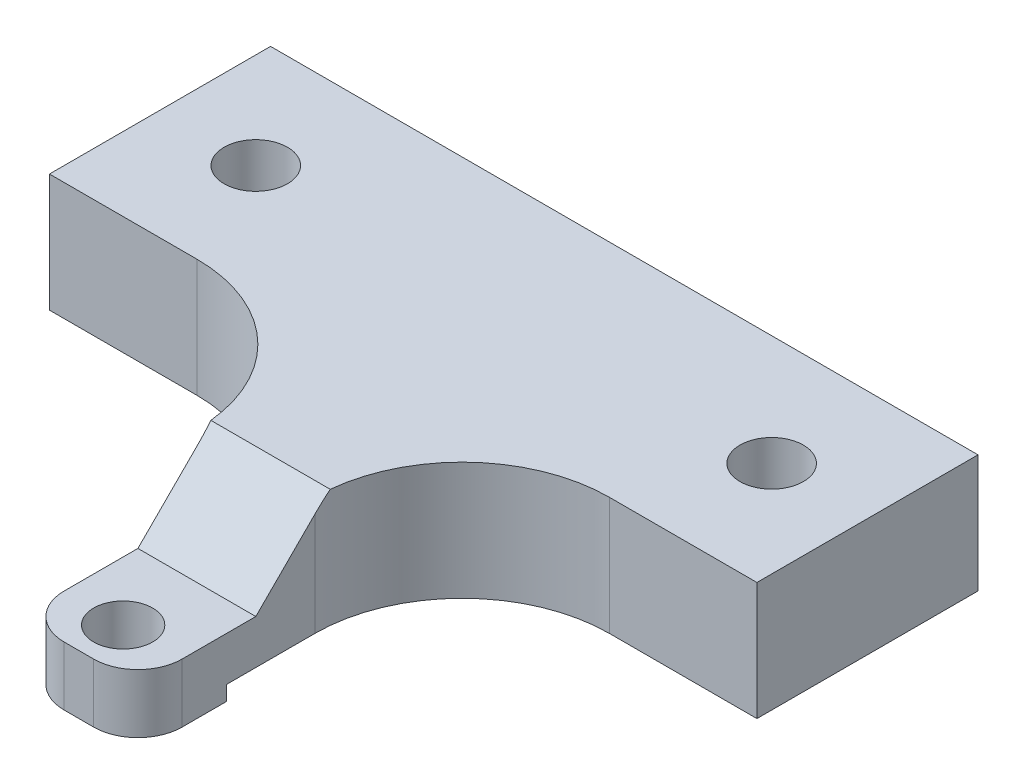
ISO-10303-21;
HEADER;
FILE_DESCRIPTION(('STEP AP214'),'2;1');
FILE_NAME('part.step','',(''),(''),'','','');
FILE_SCHEMA(('AUTOMOTIVE_DESIGN { 1 0 10303 214 1 1 1 1 }'));
ENDSEC;
DATA;
#1=APPLICATION_CONTEXT('core data for automotive mechanical design processes');
#2=APPLICATION_PROTOCOL_DEFINITION('international standard','automotive_design',2000,#1);
#3=PRODUCT_CONTEXT('',#1,'mechanical');
#4=PRODUCT('Part','Part','',(#3));
#5=PRODUCT_RELATED_PRODUCT_CATEGORY('part','',(#4));
#6=PRODUCT_DEFINITION_FORMATION('','',#4);
#7=PRODUCT_DEFINITION_CONTEXT('part definition',#1,'design');
#8=PRODUCT_DEFINITION('design','',#6,#7);
#9=PRODUCT_DEFINITION_SHAPE('','',#8);
#10=(LENGTH_UNIT() NAMED_UNIT(*) SI_UNIT(.MILLI.,.METRE.));
#11=(NAMED_UNIT(*) PLANE_ANGLE_UNIT() SI_UNIT($,.RADIAN.));
#12=(NAMED_UNIT(*) SI_UNIT($,.STERADIAN.) SOLID_ANGLE_UNIT());
#13=UNCERTAINTY_MEASURE_WITH_UNIT(LENGTH_MEASURE(1.E-05),#10,'distance_accuracy_value','');
#14=(GEOMETRIC_REPRESENTATION_CONTEXT(3) GLOBAL_UNCERTAINTY_ASSIGNED_CONTEXT((#13)) GLOBAL_UNIT_ASSIGNED_CONTEXT((#10,
#11,#12)) REPRESENTATION_CONTEXT('',''));
#15=CARTESIAN_POINT('',(0.,0.,0.));
#16=DIRECTION('',(0.,0.,1.));
#17=DIRECTION('',(1.,0.,0.));
#18=AXIS2_PLACEMENT_3D('',#15,#16,#17);
#19=CARTESIAN_POINT('',(0.,0.,0.));
#20=DIRECTION('',(0.,1.,0.));
#21=DIRECTION('',(0.,0.,1.));
#22=AXIS2_PLACEMENT_3D('',#19,#20,#21);
#23=PLANE('',#22);
#24=CARTESIAN_POINT('',(17.5,0.,-11.));
#25=DIRECTION('',(0.,-1.,0.));
#26=DIRECTION('',(0.,0.,-1.));
#27=AXIS2_PLACEMENT_3D('',#24,#25,#26);
#28=CIRCLE('',#27,3.99999999999999);
#29=CARTESIAN_POINT('',(17.5,0.,-15.));
#30=VERTEX_POINT('',#29);
#31=EDGE_CURVE('E179',#30,#30,#28,.T.);
#32=ORIENTED_EDGE('',*,*,#31,.F.);
#33=EDGE_LOOP('',(#32));
#34=FACE_BOUND('',#33,.T.);
#35=CARTESIAN_POINT('',(-17.5,0.,-11.));
#36=DIRECTION('',(0.,-1.,0.));
#37=DIRECTION('',(0.,0.,-1.));
#38=AXIS2_PLACEMENT_3D('',#35,#36,#37);
#39=CIRCLE('',#38,3.99999999999999);
#40=CARTESIAN_POINT('',(-17.5,0.,-15.));
#41=VERTEX_POINT('',#40);
#42=EDGE_CURVE('E194',#41,#41,#39,.T.);
#43=ORIENTED_EDGE('',*,*,#42,.F.);
#44=EDGE_LOOP('',(#43));
#45=FACE_BOUND('',#44,.T.);
#46=DIRECTION('',(1.,0.,0.));
#47=VECTOR('',#46,1.);
#48=CARTESIAN_POINT('',(4.,0.,12.5));
#49=LINE('',#48,#47);
#50=CARTESIAN_POINT('',(-4.,0.,12.5));
#51=VERTEX_POINT('',#50);
#52=CARTESIAN_POINT('',(4.,0.,12.5));
#53=VERTEX_POINT('',#52);
#54=EDGE_CURVE('E210',#51,#53,#49,.T.);
#55=ORIENTED_EDGE('',*,*,#54,.F.);
#56=DIRECTION('',(0.,0.,-1.));
#57=VECTOR('',#56,1.);
#58=CARTESIAN_POINT('',(-4.,0.,18.5));
#59=LINE('',#58,#57);
#60=CARTESIAN_POINT('',(-4.,0.,6.5));
#61=VERTEX_POINT('',#60);
#62=EDGE_CURVE('E225',#51,#61,#59,.T.);
#63=ORIENTED_EDGE('',*,*,#62,.T.);
#64=CARTESIAN_POINT('',(-14.,0.,6.5));
#65=DIRECTION('',(0.,1.,0.));
#66=DIRECTION('',(0.,0.,1.));
#67=AXIS2_PLACEMENT_3D('',#64,#65,#66);
#68=CIRCLE('',#67,10.);
#69=CARTESIAN_POINT('',(-14.,0.,-3.5));
#70=VERTEX_POINT('',#69);
#71=EDGE_CURVE('E242',#61,#70,#68,.T.);
#72=ORIENTED_EDGE('',*,*,#71,.T.);
#73=DIRECTION('',(-1.,0.,0.));
#74=VECTOR('',#73,1.);
#75=CARTESIAN_POINT('',(-24.,0.,-3.5));
#76=LINE('',#75,#74);
#77=CARTESIAN_POINT('',(-24.,0.,-3.5));
#78=VERTEX_POINT('',#77);
#79=EDGE_CURVE('E347',#70,#78,#76,.T.);
#80=ORIENTED_EDGE('',*,*,#79,.T.);
#81=DIRECTION('',(0.,0.,1.));
#82=VECTOR('',#81,1.);
#83=CARTESIAN_POINT('',(-24.,0.,18.5));
#84=LINE('',#83,#82);
#85=CARTESIAN_POINT('',(-24.,0.,-18.5));
#86=VERTEX_POINT('',#85);
#87=EDGE_CURVE('E353',#86,#78,#84,.T.);
#88=ORIENTED_EDGE('',*,*,#87,.F.);
#89=DIRECTION('',(-1.,0.,0.));
#90=VECTOR('',#89,1.);
#91=CARTESIAN_POINT('',(24.,0.,-18.5));
#92=LINE('',#91,#90);
#93=CARTESIAN_POINT('',(24.,0.,-18.5));
#94=VERTEX_POINT('',#93);
#95=EDGE_CURVE('E358',#94,#86,#92,.T.);
#96=ORIENTED_EDGE('',*,*,#95,.F.);
#97=DIRECTION('',(0.,0.,-1.));
#98=VECTOR('',#97,1.);
#99=CARTESIAN_POINT('',(24.,0.,18.5));
#100=LINE('',#99,#98);
#101=CARTESIAN_POINT('',(24.,0.,-3.50000000000001));
#102=VERTEX_POINT('',#101);
#103=EDGE_CURVE('E365',#102,#94,#100,.T.);
#104=ORIENTED_EDGE('',*,*,#103,.F.);
#105=DIRECTION('',(-1.,0.,0.));
#106=VECTOR('',#105,1.);
#107=CARTESIAN_POINT('',(24.,0.,-3.50000000000001));
#108=LINE('',#107,#106);
#109=CARTESIAN_POINT('',(14.,0.,-3.50000000000001));
#110=VERTEX_POINT('',#109);
#111=EDGE_CURVE('E219',#102,#110,#108,.T.);
#112=ORIENTED_EDGE('',*,*,#111,.T.);
#113=CARTESIAN_POINT('',(14.,0.,6.5));
#114=DIRECTION('',(0.,1.,0.));
#115=DIRECTION('',(0.,0.,1.));
#116=AXIS2_PLACEMENT_3D('',#113,#114,#115);
#117=CIRCLE('',#116,10.);
#118=CARTESIAN_POINT('',(4.,0.,6.5));
#119=VERTEX_POINT('',#118);
#120=EDGE_CURVE('E333',#110,#119,#117,.T.);
#121=ORIENTED_EDGE('',*,*,#120,.T.);
#122=DIRECTION('',(0.,0.,1.));
#123=VECTOR('',#122,1.);
#124=CARTESIAN_POINT('',(4.,0.,18.5));
#125=LINE('',#124,#123);
#126=EDGE_CURVE('E339',#119,#53,#125,.T.);
#127=ORIENTED_EDGE('',*,*,#126,.T.);
#128=EDGE_LOOP('',(#55,#63,#72,#80,#88,#96,#104,#112,#121,#127));
#129=FACE_BOUND('',#128,.T.);
#130=ADVANCED_FACE('F34',(#34,#45,#129),#23,.F.);
#131=CARTESIAN_POINT('',(-24.,8.,18.5));
#132=DIRECTION('',(1.,0.,0.));
#133=DIRECTION('',(0.,0.,-1.));
#134=AXIS2_PLACEMENT_3D('',#131,#132,#133);
#135=PLANE('',#134);
#136=ORIENTED_EDGE('',*,*,#87,.T.);
#137=DIRECTION('',(0.,1.,0.));
#138=VECTOR('',#137,1.);
#139=CARTESIAN_POINT('',(-24.,0.,-3.5));
#140=LINE('',#139,#138);
#141=CARTESIAN_POINT('',(-24.,8.,-3.5));
#142=VERTEX_POINT('',#141);
#143=EDGE_CURVE('E349',#78,#142,#140,.T.);
#144=ORIENTED_EDGE('',*,*,#143,.T.);
#145=DIRECTION('',(0.,0.,1.));
#146=VECTOR('',#145,1.);
#147=CARTESIAN_POINT('',(-24.,8.,18.5));
#148=LINE('',#147,#146);
#149=CARTESIAN_POINT('',(-24.,8.,-18.5));
#150=VERTEX_POINT('',#149);
#151=EDGE_CURVE('E354',#150,#142,#148,.T.);
#152=ORIENTED_EDGE('',*,*,#151,.F.);
#153=DIRECTION('',(0.,-1.,0.));
#154=VECTOR('',#153,1.);
#155=CARTESIAN_POINT('',(-24.,8.,-18.5));
#156=LINE('',#155,#154);
#157=EDGE_CURVE('E362',#150,#86,#156,.T.);
#158=ORIENTED_EDGE('',*,*,#157,.T.);
#159=EDGE_LOOP('',(#136,#144,#152,#158));
#160=FACE_BOUND('',#159,.T.);
#161=ADVANCED_FACE('F273',(#160),#135,.F.);
#162=CARTESIAN_POINT('',(24.,8.,18.5));
#163=DIRECTION('',(0.,0.,-1.));
#164=DIRECTION('',(-1.,0.,0.));
#165=AXIS2_PLACEMENT_3D('',#162,#163,#164);
#166=PLANE('',#165);
#167=DIRECTION('',(-1.,0.,0.));
#168=VECTOR('',#167,1.);
#169=CARTESIAN_POINT('',(4.,-1.,18.5));
#170=LINE('',#169,#168);
#171=CARTESIAN_POINT('',(1.,-1.,18.5));
#172=VERTEX_POINT('',#171);
#173=CARTESIAN_POINT('',(-0.999999999999997,-1.,18.5));
#174=VERTEX_POINT('',#173);
#175=EDGE_CURVE('E209',#172,#174,#170,.T.);
#176=ORIENTED_EDGE('',*,*,#175,.F.);
#177=DIRECTION('',(0.,1.,0.));
#178=VECTOR('',#177,1.);
#179=CARTESIAN_POINT('',(1.,8.,18.5));
#180=LINE('',#179,#178);
#181=CARTESIAN_POINT('',(1.,3.,18.5));
#182=VERTEX_POINT('',#181);
#183=EDGE_CURVE('E248',#172,#182,#180,.T.);
#184=ORIENTED_EDGE('',*,*,#183,.T.);
#185=DIRECTION('',(1.,0.,0.));
#186=VECTOR('',#185,1.);
#187=CARTESIAN_POINT('',(-4.,3.,18.5));
#188=LINE('',#187,#186);
#189=CARTESIAN_POINT('',(-0.999999999999998,3.,18.5));
#190=VERTEX_POINT('',#189);
#191=EDGE_CURVE('E159',#190,#182,#188,.T.);
#192=ORIENTED_EDGE('',*,*,#191,.F.);
#193=DIRECTION('',(0.,1.,0.));
#194=VECTOR('',#193,1.);
#195=CARTESIAN_POINT('',(-0.999999999999997,8.,18.5));
#196=LINE('',#195,#194);
#197=EDGE_CURVE('E170',#190,#174,#196,.F.);
#198=ORIENTED_EDGE('',*,*,#197,.T.);
#199=EDGE_LOOP('',(#176,#184,#192,#198));
#200=FACE_BOUND('',#199,.T.);
#201=ADVANCED_FACE('F261',(#200),#166,.F.);
#202=CARTESIAN_POINT('',(24.,8.,18.5));
#203=DIRECTION('',(-1.,0.,0.));
#204=DIRECTION('',(0.,0.,1.));
#205=AXIS2_PLACEMENT_3D('',#202,#203,#204);
#206=PLANE('',#205);
#207=DIRECTION('',(0.,0.,-1.));
#208=VECTOR('',#207,1.);
#209=CARTESIAN_POINT('',(24.,8.,18.5));
#210=LINE('',#209,#208);
#211=CARTESIAN_POINT('',(24.,8.,-3.50000000000001));
#212=VERTEX_POINT('',#211);
#213=CARTESIAN_POINT('',(24.,8.,-18.5));
#214=VERTEX_POINT('',#213);
#215=EDGE_CURVE('E357',#212,#214,#210,.T.);
#216=ORIENTED_EDGE('',*,*,#215,.F.);
#217=DIRECTION('',(0.,1.,0.));
#218=VECTOR('',#217,1.);
#219=CARTESIAN_POINT('',(24.,0.,-3.50000000000001));
#220=LINE('',#219,#218);
#221=EDGE_CURVE('E340',#102,#212,#220,.T.);
#222=ORIENTED_EDGE('',*,*,#221,.F.);
#223=ORIENTED_EDGE('',*,*,#103,.T.);
#224=DIRECTION('',(0.,-1.,0.));
#225=VECTOR('',#224,1.);
#226=CARTESIAN_POINT('',(24.,8.,-18.5));
#227=LINE('',#226,#225);
#228=EDGE_CURVE('E370',#214,#94,#227,.T.);
#229=ORIENTED_EDGE('',*,*,#228,.F.);
#230=EDGE_LOOP('',(#216,#222,#223,#229));
#231=FACE_BOUND('',#230,.T.);
#232=ADVANCED_FACE('F290',(#231),#206,.F.);
#233=CARTESIAN_POINT('',(24.,8.,-18.5));
#234=DIRECTION('',(0.,0.,1.));
#235=DIRECTION('',(1.,0.,0.));
#236=AXIS2_PLACEMENT_3D('',#233,#234,#235);
#237=PLANE('',#236);
#238=ORIENTED_EDGE('',*,*,#95,.T.);
#239=ORIENTED_EDGE('',*,*,#157,.F.);
#240=DIRECTION('',(-1.,0.,0.));
#241=VECTOR('',#240,1.);
#242=CARTESIAN_POINT('',(24.,8.,-18.5));
#243=LINE('',#242,#241);
#244=EDGE_CURVE('E360',#214,#150,#243,.T.);
#245=ORIENTED_EDGE('',*,*,#244,.F.);
#246=ORIENTED_EDGE('',*,*,#228,.T.);
#247=EDGE_LOOP('',(#238,#239,#245,#246));
#248=FACE_BOUND('',#247,.T.);
#249=ADVANCED_FACE('F287',(#248),#237,.F.);
#250=CARTESIAN_POINT('',(0.,8.,0.));
#251=DIRECTION('',(0.,1.,0.));
#252=DIRECTION('',(0.,0.,1.));
#253=AXIS2_PLACEMENT_3D('',#250,#251,#252);
#254=PLANE('',#253);
#255=CARTESIAN_POINT('',(-14.,8.,6.5));
#256=DIRECTION('',(0.,1.,0.));
#257=DIRECTION('',(0.,0.,1.));
#258=AXIS2_PLACEMENT_3D('',#255,#256,#257);
#259=CIRCLE('',#258,10.);
#260=CARTESIAN_POINT('',(-14.,8.,-3.5));
#261=VERTEX_POINT('',#260);
#262=CARTESIAN_POINT('',(-4.0501256289338,8.,5.49999999999999));
#263=VERTEX_POINT('',#262);
#264=EDGE_CURVE('E329',#261,#263,#259,.F.);
#265=ORIENTED_EDGE('',*,*,#264,.T.);
#266=DIRECTION('',(1.,0.,0.));
#267=VECTOR('',#266,1.);
#268=CARTESIAN_POINT('',(4.,8.,5.49999999999999));
#269=LINE('',#268,#267);
#270=CARTESIAN_POINT('',(4.0501256289338,8.,5.49999999999999));
#271=VERTEX_POINT('',#270);
#272=EDGE_CURVE('E244',#263,#271,#269,.T.);
#273=ORIENTED_EDGE('',*,*,#272,.T.);
#274=CARTESIAN_POINT('',(14.,8.,6.5));
#275=DIRECTION('',(0.,1.,0.));
#276=DIRECTION('',(0.,0.,1.));
#277=AXIS2_PLACEMENT_3D('',#274,#275,#276);
#278=CIRCLE('',#277,10.);
#279=CARTESIAN_POINT('',(14.,8.,-3.50000000000001));
#280=VERTEX_POINT('',#279);
#281=EDGE_CURVE('E319',#271,#280,#278,.F.);
#282=ORIENTED_EDGE('',*,*,#281,.T.);
#283=DIRECTION('',(-1.,0.,0.));
#284=VECTOR('',#283,1.);
#285=CARTESIAN_POINT('',(24.,8.,-3.50000000000001));
#286=LINE('',#285,#284);
#287=EDGE_CURVE('E235',#212,#280,#286,.T.);
#288=ORIENTED_EDGE('',*,*,#287,.F.);
#289=ORIENTED_EDGE('',*,*,#215,.T.);
#290=ORIENTED_EDGE('',*,*,#244,.T.);
#291=ORIENTED_EDGE('',*,*,#151,.T.);
#292=DIRECTION('',(-1.,0.,0.));
#293=VECTOR('',#292,1.);
#294=CARTESIAN_POINT('',(-24.,8.,-3.5));
#295=LINE('',#294,#293);
#296=EDGE_CURVE('E344',#261,#142,#295,.T.);
#297=ORIENTED_EDGE('',*,*,#296,.F.);
#298=EDGE_LOOP('',(#265,#273,#282,#288,#289,#290,#291,#297));
#299=FACE_BOUND('',#298,.T.);
#300=CARTESIAN_POINT('',(17.5,8.,-11.));
#301=DIRECTION('',(0.,-1.,0.));
#302=DIRECTION('',(0.,0.,-1.));
#303=AXIS2_PLACEMENT_3D('',#300,#301,#302);
#304=CIRCLE('',#303,2.15);
#305=CARTESIAN_POINT('',(17.5,8.,-13.15));
#306=VERTEX_POINT('',#305);
#307=EDGE_CURVE('E191',#306,#306,#304,.T.);
#308=ORIENTED_EDGE('',*,*,#307,.T.);
#309=EDGE_LOOP('',(#308));
#310=FACE_BOUND('',#309,.T.);
#311=CARTESIAN_POINT('',(-17.5,8.,-11.));
#312=DIRECTION('',(0.,-1.,0.));
#313=DIRECTION('',(0.,0.,-1.));
#314=AXIS2_PLACEMENT_3D('',#311,#312,#313);
#315=CIRCLE('',#314,2.15);
#316=CARTESIAN_POINT('',(-17.5,8.,-13.15));
#317=VERTEX_POINT('',#316);
#318=EDGE_CURVE('E203',#317,#317,#315,.T.);
#319=ORIENTED_EDGE('',*,*,#318,.T.);
#320=EDGE_LOOP('',(#319));
#321=FACE_BOUND('',#320,.T.);
#322=ADVANCED_FACE('F285',(#299,#310,#321),#254,.T.);
#323=CARTESIAN_POINT('',(-24.,0.,-3.5));
#324=DIRECTION('',(0.,0.,-1.));
#325=DIRECTION('',(-1.,0.,0.));
#326=AXIS2_PLACEMENT_3D('',#323,#324,#325);
#327=PLANE('',#326);
#328=ORIENTED_EDGE('',*,*,#79,.F.);
#329=DIRECTION('',(0.,1.,0.));
#330=VECTOR('',#329,1.);
#331=CARTESIAN_POINT('',(-14.,8.,-3.5));
#332=LINE('',#331,#330);
#333=EDGE_CURVE('E320',#70,#261,#332,.T.);
#334=ORIENTED_EDGE('',*,*,#333,.T.);
#335=ORIENTED_EDGE('',*,*,#296,.T.);
#336=ORIENTED_EDGE('',*,*,#143,.F.);
#337=EDGE_LOOP('',(#328,#334,#335,#336));
#338=FACE_BOUND('',#337,.T.);
#339=ADVANCED_FACE('F377',(#338),#327,.F.);
#340=CARTESIAN_POINT('',(-4.,0.,18.5));
#341=DIRECTION('',(1.,0.,0.));
#342=DIRECTION('',(0.,0.,-1.));
#343=AXIS2_PLACEMENT_3D('',#340,#341,#342);
#344=PLANE('',#343);
#345=DIRECTION('',(0.,0.,-1.));
#346=VECTOR('',#345,1.);
#347=CARTESIAN_POINT('',(-4.,-1.,18.5));
#348=LINE('',#347,#346);
#349=CARTESIAN_POINT('',(-4.,-1.,15.5));
#350=VERTEX_POINT('',#349);
#351=CARTESIAN_POINT('',(-4.,-1.,12.5));
#352=VERTEX_POINT('',#351);
#353=EDGE_CURVE('E212',#350,#352,#348,.T.);
#354=ORIENTED_EDGE('',*,*,#353,.F.);
#355=DIRECTION('',(0.,1.,0.));
#356=VECTOR('',#355,1.);
#357=CARTESIAN_POINT('',(-4.,0.,15.5));
#358=LINE('',#357,#356);
#359=CARTESIAN_POINT('',(-4.,3.,15.5));
#360=VERTEX_POINT('',#359);
#361=EDGE_CURVE('E11',#350,#360,#358,.T.);
#362=ORIENTED_EDGE('',*,*,#361,.T.);
#363=DIRECTION('',(0.,0.,1.));
#364=VECTOR('',#363,1.);
#365=CARTESIAN_POINT('',(-4.,3.,18.5));
#366=LINE('',#365,#364);
#367=CARTESIAN_POINT('',(-4.,3.,10.5));
#368=VERTEX_POINT('',#367);
#369=EDGE_CURVE('E391',#368,#360,#366,.T.);
#370=ORIENTED_EDGE('',*,*,#369,.F.);
#371=DIRECTION('',(0.,0.707106781186546,-0.707106781186549));
#372=VECTOR('',#371,1.);
#373=CARTESIAN_POINT('',(-4.,3.00000000000001,10.5));
#374=LINE('',#373,#372);
#375=CARTESIAN_POINT('',(-4.,7.,6.5));
#376=VERTEX_POINT('',#375);
#377=EDGE_CURVE('E175',#368,#376,#374,.T.);
#378=ORIENTED_EDGE('',*,*,#377,.T.);
#379=DIRECTION('',(0.,1.,0.));
#380=VECTOR('',#379,1.);
#381=CARTESIAN_POINT('',(-4.,0.,6.5));
#382=LINE('',#381,#380);
#383=EDGE_CURVE('E313',#376,#61,#382,.F.);
#384=ORIENTED_EDGE('',*,*,#383,.T.);
#385=ORIENTED_EDGE('',*,*,#62,.F.);
#386=DIRECTION('',(0.,1.,0.));
#387=VECTOR('',#386,1.);
#388=CARTESIAN_POINT('',(-4.,-1.,12.5));
#389=LINE('',#388,#387);
#390=EDGE_CURVE('E230',#352,#51,#389,.T.);
#391=ORIENTED_EDGE('',*,*,#390,.F.);
#392=EDGE_LOOP('',(#354,#362,#370,#378,#384,#385,#391));
#393=FACE_BOUND('',#392,.T.);
#394=ADVANCED_FACE('F387',(#393),#344,.F.);
#395=CARTESIAN_POINT('',(4.,0.,18.5));
#396=DIRECTION('',(-1.,0.,0.));
#397=DIRECTION('',(0.,0.,1.));
#398=AXIS2_PLACEMENT_3D('',#395,#396,#397);
#399=PLANE('',#398);
#400=DIRECTION('',(0.,0.,-1.));
#401=VECTOR('',#400,1.);
#402=CARTESIAN_POINT('',(4.,3.,18.5));
#403=LINE('',#402,#401);
#404=CARTESIAN_POINT('',(4.,3.,15.5));
#405=VERTEX_POINT('',#404);
#406=CARTESIAN_POINT('',(4.,3.,10.5));
#407=VERTEX_POINT('',#406);
#408=EDGE_CURVE('E149',#405,#407,#403,.T.);
#409=ORIENTED_EDGE('',*,*,#408,.F.);
#410=DIRECTION('',(0.,1.,0.));
#411=VECTOR('',#410,1.);
#412=CARTESIAN_POINT('',(4.,0.,15.5));
#413=LINE('',#412,#411);
#414=CARTESIAN_POINT('',(4.,-1.,15.5));
#415=VERTEX_POINT('',#414);
#416=EDGE_CURVE('E57',#405,#415,#413,.F.);
#417=ORIENTED_EDGE('',*,*,#416,.T.);
#418=DIRECTION('',(0.,0.,1.));
#419=VECTOR('',#418,1.);
#420=CARTESIAN_POINT('',(4.,-1.,18.5));
#421=LINE('',#420,#419);
#422=CARTESIAN_POINT('',(4.,-1.,12.5));
#423=VERTEX_POINT('',#422);
#424=EDGE_CURVE('E207',#423,#415,#421,.T.);
#425=ORIENTED_EDGE('',*,*,#424,.F.);
#426=DIRECTION('',(0.,1.,0.));
#427=VECTOR('',#426,1.);
#428=CARTESIAN_POINT('',(4.,-1.,12.5));
#429=LINE('',#428,#427);
#430=EDGE_CURVE('E216',#423,#53,#429,.T.);
#431=ORIENTED_EDGE('',*,*,#430,.T.);
#432=ORIENTED_EDGE('',*,*,#126,.F.);
#433=DIRECTION('',(0.,1.,0.));
#434=VECTOR('',#433,1.);
#435=CARTESIAN_POINT('',(4.,8.,6.5));
#436=LINE('',#435,#434);
#437=CARTESIAN_POINT('',(4.,7.,6.5));
#438=VERTEX_POINT('',#437);
#439=EDGE_CURVE('E167',#119,#438,#436,.T.);
#440=ORIENTED_EDGE('',*,*,#439,.T.);
#441=DIRECTION('',(0.,-0.707106781186546,0.707106781186549));
#442=VECTOR('',#441,1.);
#443=CARTESIAN_POINT('',(4.,3.00000000000001,10.5));
#444=LINE('',#443,#442);
#445=EDGE_CURVE('E163',#438,#407,#444,.T.);
#446=ORIENTED_EDGE('',*,*,#445,.T.);
#447=EDGE_LOOP('',(#409,#417,#425,#431,#432,#440,#446));
#448=FACE_BOUND('',#447,.T.);
#449=ADVANCED_FACE('F164',(#448),#399,.F.);
#450=CARTESIAN_POINT('',(24.,0.,-3.50000000000001));
#451=DIRECTION('',(0.,0.,-1.));
#452=DIRECTION('',(-1.,0.,0.));
#453=AXIS2_PLACEMENT_3D('',#450,#451,#452);
#454=PLANE('',#453);
#455=ORIENTED_EDGE('',*,*,#287,.T.);
#456=DIRECTION('',(0.,1.,0.));
#457=VECTOR('',#456,1.);
#458=CARTESIAN_POINT('',(14.,0.,-3.50000000000001));
#459=LINE('',#458,#457);
#460=EDGE_CURVE('E332',#280,#110,#459,.F.);
#461=ORIENTED_EDGE('',*,*,#460,.T.);
#462=ORIENTED_EDGE('',*,*,#111,.F.);
#463=ORIENTED_EDGE('',*,*,#221,.T.);
#464=EDGE_LOOP('',(#455,#461,#462,#463));
#465=FACE_BOUND('',#464,.T.);
#466=ADVANCED_FACE('F301',(#465),#454,.F.);
#467=CARTESIAN_POINT('',(14.,0.,6.5));
#468=DIRECTION('',(0.,-1.,0.));
#469=DIRECTION('',(0.,0.,-1.));
#470=AXIS2_PLACEMENT_3D('',#467,#468,#469);
#471=CYLINDRICAL_SURFACE('',#470,10.);
#472=ORIENTED_EDGE('',*,*,#281,.F.);
#473=CARTESIAN_POINT('',(14.,7.,6.5));
#474=DIRECTION('',(0.,0.707106781186549,0.707106781186546));
#475=DIRECTION('',(0.,-0.707106781186546,0.707106781186549));
#476=AXIS2_PLACEMENT_3D('',#473,#474,#475);
#477=ELLIPSE('',#476,14.1421356237309,10.);
#478=EDGE_CURVE('E171',#271,#438,#477,.T.);
#479=ORIENTED_EDGE('',*,*,#478,.T.);
#480=ORIENTED_EDGE('',*,*,#439,.F.);
#481=ORIENTED_EDGE('',*,*,#120,.F.);
#482=ORIENTED_EDGE('',*,*,#460,.F.);
#483=EDGE_LOOP('',(#472,#479,#480,#481,#482));
#484=FACE_BOUND('',#483,.T.);
#485=ADVANCED_FACE('F297',(#484),#471,.F.);
#486=CARTESIAN_POINT('',(-14.,0.,6.5));
#487=DIRECTION('',(0.,-1.,0.));
#488=DIRECTION('',(0.,0.,-1.));
#489=AXIS2_PLACEMENT_3D('',#486,#487,#488);
#490=CYLINDRICAL_SURFACE('',#489,10.);
#491=ORIENTED_EDGE('',*,*,#383,.F.);
#492=CARTESIAN_POINT('',(-14.,7.,6.5));
#493=DIRECTION('',(0.,0.707106781186549,0.707106781186546));
#494=DIRECTION('',(0.,-0.707106781186546,0.707106781186549));
#495=AXIS2_PLACEMENT_3D('',#492,#493,#494);
#496=ELLIPSE('',#495,14.1421356237309,10.);
#497=EDGE_CURVE('E241',#376,#263,#496,.T.);
#498=ORIENTED_EDGE('',*,*,#497,.T.);
#499=ORIENTED_EDGE('',*,*,#264,.F.);
#500=ORIENTED_EDGE('',*,*,#333,.F.);
#501=ORIENTED_EDGE('',*,*,#71,.F.);
#502=EDGE_LOOP('',(#491,#498,#499,#500,#501));
#503=FACE_BOUND('',#502,.T.);
#504=ADVANCED_FACE('F300',(#503),#490,.F.);
#505=CARTESIAN_POINT('',(4.,-1.,12.5));
#506=DIRECTION('',(0.,0.,1.));
#507=DIRECTION('',(1.,0.,0.));
#508=AXIS2_PLACEMENT_3D('',#505,#506,#507);
#509=PLANE('',#508);
#510=ORIENTED_EDGE('',*,*,#54,.T.);
#511=ORIENTED_EDGE('',*,*,#430,.F.);
#512=DIRECTION('',(1.,0.,0.));
#513=VECTOR('',#512,1.);
#514=CARTESIAN_POINT('',(4.,-1.,12.5));
#515=LINE('',#514,#513);
#516=EDGE_CURVE('E214',#352,#423,#515,.T.);
#517=ORIENTED_EDGE('',*,*,#516,.F.);
#518=ORIENTED_EDGE('',*,*,#390,.T.);
#519=EDGE_LOOP('',(#510,#511,#517,#518));
#520=FACE_BOUND('',#519,.T.);
#521=ADVANCED_FACE('F304',(#520),#509,.F.);
#522=CARTESIAN_POINT('',(0.,-1.,0.));
#523=DIRECTION('',(0.,1.,0.));
#524=DIRECTION('',(0.,0.,1.));
#525=AXIS2_PLACEMENT_3D('',#522,#523,#524);
#526=PLANE('',#525);
#527=CARTESIAN_POINT('',(0.,-1.,15.5));
#528=DIRECTION('',(0.,1.,0.));
#529=DIRECTION('',(0.,0.,1.));
#530=AXIS2_PLACEMENT_3D('',#527,#528,#529);
#531=CIRCLE('',#530,2.);
#532=CARTESIAN_POINT('',(0.,-1.,17.5));
#533=VERTEX_POINT('',#532);
#534=EDGE_CURVE('E206',#533,#533,#531,.T.);
#535=ORIENTED_EDGE('',*,*,#534,.T.);
#536=EDGE_LOOP('',(#535));
#537=FACE_BOUND('',#536,.T.);
#538=ORIENTED_EDGE('',*,*,#424,.T.);
#539=CARTESIAN_POINT('',(1.,-1.,15.5));
#540=DIRECTION('',(0.,1.,0.));
#541=DIRECTION('',(0.,0.,1.));
#542=AXIS2_PLACEMENT_3D('',#539,#540,#541);
#543=CIRCLE('',#542,3.);
#544=EDGE_CURVE('E42',#415,#172,#543,.F.);
#545=ORIENTED_EDGE('',*,*,#544,.T.);
#546=ORIENTED_EDGE('',*,*,#175,.T.);
#547=CARTESIAN_POINT('',(-0.999999999999998,-1.,15.5));
#548=DIRECTION('',(0.,1.,0.));
#549=DIRECTION('',(0.,0.,1.));
#550=AXIS2_PLACEMENT_3D('',#547,#548,#549);
#551=CIRCLE('',#550,3.);
#552=EDGE_CURVE('E49',#174,#350,#551,.F.);
#553=ORIENTED_EDGE('',*,*,#552,.T.);
#554=ORIENTED_EDGE('',*,*,#353,.T.);
#555=ORIENTED_EDGE('',*,*,#516,.T.);
#556=EDGE_LOOP('',(#538,#545,#546,#553,#554,#555));
#557=FACE_BOUND('',#556,.T.);
#558=ADVANCED_FACE('F257',(#537,#557),#526,.F.);
#559=CARTESIAN_POINT('',(0.,-1.000025,15.5));
#560=DIRECTION('',(0.,1.,0.));
#561=DIRECTION('',(0.,0.,1.));
#562=AXIS2_PLACEMENT_3D('',#559,#560,#561);
#563=CYLINDRICAL_SURFACE('',#562,2.);
#564=CARTESIAN_POINT('',(0.,3.,15.5));
#565=DIRECTION('',(0.,-1.,0.));
#566=DIRECTION('',(0.,0.,-1.));
#567=AXIS2_PLACEMENT_3D('',#564,#565,#566);
#568=CIRCLE('',#567,2.);
#569=CARTESIAN_POINT('',(0.,3.,17.5));
#570=VERTEX_POINT('',#569);
#571=EDGE_CURVE('E176',#570,#570,#568,.F.);
#572=CARTESIAN_POINT('',(0.,3.,17.5));
#573=CARTESIAN_POINT('',(0.,2.95833333333333,17.5));
#574=CARTESIAN_POINT('',(0.,2.91666666666667,17.5));
#575=CARTESIAN_POINT('',(0.,2.83333333333333,17.5));
#576=CARTESIAN_POINT('',(0.,2.79166666666667,17.5));
#577=CARTESIAN_POINT('',(0.,2.70833333333333,17.5));
#578=CARTESIAN_POINT('',(0.,2.66666666666667,17.5));
#579=CARTESIAN_POINT('',(0.,2.58333333333333,17.5));
#580=CARTESIAN_POINT('',(0.,2.54166666666667,17.5));
#581=CARTESIAN_POINT('',(0.,2.45833333333333,17.5));
#582=CARTESIAN_POINT('',(0.,2.41666666666667,17.5));
#583=CARTESIAN_POINT('',(0.,2.33333333333333,17.5));
#584=CARTESIAN_POINT('',(0.,2.29166666666667,17.5));
#585=CARTESIAN_POINT('',(0.,2.20833333333333,17.5));
#586=CARTESIAN_POINT('',(0.,2.16666666666667,17.5));
#587=CARTESIAN_POINT('',(0.,2.08333333333333,17.5));
#588=CARTESIAN_POINT('',(0.,2.04166666666667,17.5));
#589=CARTESIAN_POINT('',(0.,1.95833333333333,17.5));
#590=CARTESIAN_POINT('',(0.,1.91666666666667,17.5));
#591=CARTESIAN_POINT('',(0.,1.83333333333333,17.5));
#592=CARTESIAN_POINT('',(0.,1.79166666666667,17.5));
#593=CARTESIAN_POINT('',(0.,1.70833333333333,17.5));
#594=CARTESIAN_POINT('',(0.,1.66666666666667,17.5));
#595=CARTESIAN_POINT('',(0.,1.58333333333333,17.5));
#596=CARTESIAN_POINT('',(0.,1.54166666666667,17.5));
#597=CARTESIAN_POINT('',(0.,1.45833333333333,17.5));
#598=CARTESIAN_POINT('',(0.,1.41666666666667,17.5));
#599=CARTESIAN_POINT('',(0.,1.33333333333333,17.5));
#600=CARTESIAN_POINT('',(0.,1.29166666666667,17.5));
#601=CARTESIAN_POINT('',(0.,1.20833333333333,17.5));
#602=CARTESIAN_POINT('',(0.,1.16666666666667,17.5));
#603=CARTESIAN_POINT('',(0.,1.08333333333333,17.5));
#604=CARTESIAN_POINT('',(0.,1.04166666666667,17.5));
#605=CARTESIAN_POINT('',(0.,0.958333333333333,17.5));
#606=CARTESIAN_POINT('',(0.,0.916666666666667,17.5));
#607=CARTESIAN_POINT('',(0.,0.833333333333333,17.5));
#608=CARTESIAN_POINT('',(0.,0.791666666666667,17.5));
#609=CARTESIAN_POINT('',(0.,0.708333333333333,17.5));
#610=CARTESIAN_POINT('',(0.,0.666666666666667,17.5));
#611=CARTESIAN_POINT('',(0.,0.583333333333334,17.5));
#612=CARTESIAN_POINT('',(0.,0.541666666666667,17.5));
#613=CARTESIAN_POINT('',(0.,0.458333333333334,17.5));
#614=CARTESIAN_POINT('',(0.,0.416666666666667,17.5));
#615=CARTESIAN_POINT('',(0.,0.333333333333333,17.5));
#616=CARTESIAN_POINT('',(0.,0.291666666666667,17.5));
#617=CARTESIAN_POINT('',(0.,0.208333333333333,17.5));
#618=CARTESIAN_POINT('',(0.,0.166666666666667,17.5));
#619=CARTESIAN_POINT('',(0.,0.0833333333333332,17.5));
#620=CARTESIAN_POINT('',(0.,0.0416666666666665,17.5));
#621=CARTESIAN_POINT('',(0.,-0.0416666666666667,17.5));
#622=CARTESIAN_POINT('',(0.,-0.0833333333333333,17.5));
#623=CARTESIAN_POINT('',(0.,-0.166666666666666,17.5));
#624=CARTESIAN_POINT('',(0.,-0.208333333333333,17.5));
#625=CARTESIAN_POINT('',(0.,-0.291666666666667,17.5));
#626=CARTESIAN_POINT('',(0.,-0.333333333333333,17.5));
#627=CARTESIAN_POINT('',(0.,-0.416666666666667,17.5));
#628=CARTESIAN_POINT('',(0.,-0.458333333333333,17.5));
#629=CARTESIAN_POINT('',(0.,-0.541666666666667,17.5));
#630=CARTESIAN_POINT('',(0.,-0.583333333333333,17.5));
#631=CARTESIAN_POINT('',(0.,-0.666666666666667,17.5));
#632=CARTESIAN_POINT('',(0.,-0.708333333333333,17.5));
#633=CARTESIAN_POINT('',(0.,-0.791666666666667,17.5));
#634=CARTESIAN_POINT('',(0.,-0.833333333333333,17.5));
#635=CARTESIAN_POINT('',(0.,-0.916666666666667,17.5));
#636=CARTESIAN_POINT('',(0.,-0.958333333333333,17.5));
#637=CARTESIAN_POINT('',(0.,-1.,17.5));
#638=B_SPLINE_CURVE_WITH_KNOTS('',3,(#572,#573,#574,#575,#576,#577,#578,#579,#580,#581,#582,
#583,#584,#585,#586,#587,#588,#589,#590,#591,#592,#593,#594,#595,#596,#597,#598,#599,#600,#601,
#602,#603,#604,#605,#606,#607,#608,#609,#610,#611,#612,#613,#614,#615,#616,#617,#618,#619,#620,
#621,#622,#623,#624,#625,#626,#627,#628,#629,#630,#631,#632,#633,#634,#635,#636,#637),
.UNSPECIFIED.,.F.,.F.,(4,2,2,2,2,2,2,2,2,2,2,2,2,2,2,2,2,2,2,2,2,2,2,2,2,2,2,2,2,2,2,2,4),(0.,
0.125,0.25,0.375,0.5,0.625,0.75,0.875,1.,1.125,1.25,1.375,1.5,1.625,1.75,1.875,2.,2.125,2.25,
2.375,2.5,2.625,2.75,2.875,3.,3.125,3.25,3.375,3.5,3.625,3.75,3.875,4.),.UNSPECIFIED.);
#639=EDGE_CURVE('BSEAM428',#570,#533,#638,.T.);
#640=ORIENTED_EDGE('',*,*,#571,.T.);
#641=ORIENTED_EDGE('',*,*,#534,.F.);
#642=ORIENTED_EDGE('',*,*,#639,.T.);
#643=ORIENTED_EDGE('',*,*,#639,.F.);
#644=EDGE_LOOP('',(#640,#642,#641,#643));
#645=FACE_BOUND('',#644,.T.);
#646=ADVANCED_FACE('F428',(#645),#563,.F.);
#647=CARTESIAN_POINT('',(-17.5,0.,-11.));
#648=DIRECTION('',(0.,-1.,0.));
#649=DIRECTION('',(0.,0.,-1.));
#650=AXIS2_PLACEMENT_3D('',#647,#648,#649);
#651=CYLINDRICAL_SURFACE('',#650,2.15000000000001);
#652=ORIENTED_EDGE('',*,*,#318,.F.);
#653=EDGE_LOOP('',(#652));
#654=FACE_BOUND('',#653,.T.);
#655=CARTESIAN_POINT('',(-17.5,4.4,-11.));
#656=DIRECTION('',(0.,-1.,0.));
#657=DIRECTION('',(0.,0.,-1.));
#658=AXIS2_PLACEMENT_3D('',#655,#656,#657);
#659=CIRCLE('',#658,2.15000000000001);
#660=CARTESIAN_POINT('',(-17.5,4.4,-13.15));
#661=VERTEX_POINT('',#660);
#662=EDGE_CURVE('E200',#661,#661,#659,.T.);
#663=ORIENTED_EDGE('',*,*,#662,.T.);
#664=EDGE_LOOP('',(#663));
#665=FACE_BOUND('',#664,.T.);
#666=ADVANCED_FACE('F508',(#654,#665),#651,.F.);
#667=CARTESIAN_POINT('',(-15.35,4.4,-11.));
#668=DIRECTION('',(0.,1.,0.));
#669=DIRECTION('',(0.,0.,1.));
#670=AXIS2_PLACEMENT_3D('',#667,#668,#669);
#671=PLANE('',#670);
#672=ORIENTED_EDGE('',*,*,#662,.F.);
#673=EDGE_LOOP('',(#672));
#674=FACE_BOUND('',#673,.T.);
#675=CARTESIAN_POINT('',(-17.5,4.4,-11.));
#676=DIRECTION('',(0.,-1.,0.));
#677=DIRECTION('',(0.,0.,-1.));
#678=AXIS2_PLACEMENT_3D('',#675,#676,#677);
#679=CIRCLE('',#678,3.99999999999999);
#680=CARTESIAN_POINT('',(-17.5,4.4,-15.));
#681=VERTEX_POINT('',#680);
#682=EDGE_CURVE('E197',#681,#681,#679,.T.);
#683=ORIENTED_EDGE('',*,*,#682,.T.);
#684=EDGE_LOOP('',(#683));
#685=FACE_BOUND('',#684,.T.);
#686=ADVANCED_FACE('F513',(#674,#685),#671,.F.);
#687=CARTESIAN_POINT('',(-17.5,0.,-11.));
#688=DIRECTION('',(0.,-1.,0.));
#689=DIRECTION('',(0.,0.,-1.));
#690=AXIS2_PLACEMENT_3D('',#687,#688,#689);
#691=CYLINDRICAL_SURFACE('',#690,3.99999999999999);
#692=ORIENTED_EDGE('',*,*,#682,.F.);
#693=EDGE_LOOP('',(#692));
#694=FACE_BOUND('',#693,.T.);
#695=ORIENTED_EDGE('',*,*,#42,.T.);
#696=EDGE_LOOP('',(#695));
#697=FACE_BOUND('',#696,.T.);
#698=ADVANCED_FACE('F523',(#694,#697),#691,.F.);
#699=CARTESIAN_POINT('',(17.5,0.,-11.));
#700=DIRECTION('',(0.,-1.,0.));
#701=DIRECTION('',(0.,0.,-1.));
#702=AXIS2_PLACEMENT_3D('',#699,#700,#701);
#703=CYLINDRICAL_SURFACE('',#702,2.15000000000001);
#704=ORIENTED_EDGE('',*,*,#307,.F.);
#705=EDGE_LOOP('',(#704));
#706=FACE_BOUND('',#705,.T.);
#707=CARTESIAN_POINT('',(17.5,4.4,-11.));
#708=DIRECTION('',(0.,-1.,0.));
#709=DIRECTION('',(0.,0.,-1.));
#710=AXIS2_PLACEMENT_3D('',#707,#708,#709);
#711=CIRCLE('',#710,2.15000000000001);
#712=CARTESIAN_POINT('',(17.5,4.4,-13.15));
#713=VERTEX_POINT('',#712);
#714=EDGE_CURVE('E188',#713,#713,#711,.T.);
#715=ORIENTED_EDGE('',*,*,#714,.T.);
#716=EDGE_LOOP('',(#715));
#717=FACE_BOUND('',#716,.T.);
#718=ADVANCED_FACE('F533',(#706,#717),#703,.F.);
#719=CARTESIAN_POINT('',(19.65,4.4,-11.));
#720=DIRECTION('',(0.,1.,0.));
#721=DIRECTION('',(0.,0.,1.));
#722=AXIS2_PLACEMENT_3D('',#719,#720,#721);
#723=PLANE('',#722);
#724=ORIENTED_EDGE('',*,*,#714,.F.);
#725=EDGE_LOOP('',(#724));
#726=FACE_BOUND('',#725,.T.);
#727=CARTESIAN_POINT('',(17.5,4.4,-11.));
#728=DIRECTION('',(0.,-1.,0.));
#729=DIRECTION('',(0.,0.,-1.));
#730=AXIS2_PLACEMENT_3D('',#727,#728,#729);
#731=CIRCLE('',#730,3.99999999999999);
#732=CARTESIAN_POINT('',(17.5,4.4,-15.));
#733=VERTEX_POINT('',#732);
#734=EDGE_CURVE('E185',#733,#733,#731,.T.);
#735=ORIENTED_EDGE('',*,*,#734,.T.);
#736=EDGE_LOOP('',(#735));
#737=FACE_BOUND('',#736,.T.);
#738=ADVANCED_FACE('F543',(#726,#737),#723,.F.);
#739=CARTESIAN_POINT('',(17.5,0.,-11.));
#740=DIRECTION('',(0.,-1.,0.));
#741=DIRECTION('',(0.,0.,-1.));
#742=AXIS2_PLACEMENT_3D('',#739,#740,#741);
#743=CYLINDRICAL_SURFACE('',#742,3.99999999999999);
#744=ORIENTED_EDGE('',*,*,#734,.F.);
#745=EDGE_LOOP('',(#744));
#746=FACE_BOUND('',#745,.T.);
#747=ORIENTED_EDGE('',*,*,#31,.T.);
#748=EDGE_LOOP('',(#747));
#749=FACE_BOUND('',#748,.T.);
#750=ADVANCED_FACE('F439',(#746,#749),#743,.F.);
#751=CARTESIAN_POINT('',(0.,3.,0.));
#752=DIRECTION('',(0.,-1.,0.));
#753=DIRECTION('',(0.,0.,-1.));
#754=AXIS2_PLACEMENT_3D('',#751,#752,#753);
#755=PLANE('',#754);
#756=ORIENTED_EDGE('',*,*,#191,.T.);
#757=CARTESIAN_POINT('',(1.,3.,15.5));
#758=DIRECTION('',(0.,-1.,0.));
#759=DIRECTION('',(0.,0.,-1.));
#760=AXIS2_PLACEMENT_3D('',#757,#758,#759);
#761=CIRCLE('',#760,3.);
#762=EDGE_CURVE('E158',#182,#405,#761,.F.);
#763=ORIENTED_EDGE('',*,*,#762,.T.);
#764=ORIENTED_EDGE('',*,*,#408,.T.);
#765=DIRECTION('',(-1.,0.,0.));
#766=VECTOR('',#765,1.);
#767=CARTESIAN_POINT('',(-4.,3.,10.5));
#768=LINE('',#767,#766);
#769=EDGE_CURVE('E156',#407,#368,#768,.T.);
#770=ORIENTED_EDGE('',*,*,#769,.T.);
#771=ORIENTED_EDGE('',*,*,#369,.T.);
#772=CARTESIAN_POINT('',(-0.999999999999998,3.,15.5));
#773=DIRECTION('',(0.,-1.,0.));
#774=DIRECTION('',(0.,0.,-1.));
#775=AXIS2_PLACEMENT_3D('',#772,#773,#774);
#776=CIRCLE('',#775,3.);
#777=EDGE_CURVE('E251',#360,#190,#776,.F.);
#778=ORIENTED_EDGE('',*,*,#777,.T.);
#779=EDGE_LOOP('',(#756,#763,#764,#770,#771,#778));
#780=FACE_BOUND('',#779,.T.);
#781=ORIENTED_EDGE('',*,*,#571,.F.);
#782=EDGE_LOOP('',(#781));
#783=FACE_BOUND('',#782,.T.);
#784=ADVANCED_FACE('F152',(#780,#783),#755,.F.);
#785=CARTESIAN_POINT('',(-4.,3.00000000000001,10.5));
#786=DIRECTION('',(0.,0.707106781186549,0.707106781186546));
#787=DIRECTION('',(1.,0.,0.));
#788=AXIS2_PLACEMENT_3D('',#785,#786,#787);
#789=PLANE('',#788);
#790=ORIENTED_EDGE('',*,*,#478,.F.);
#791=ORIENTED_EDGE('',*,*,#272,.F.);
#792=ORIENTED_EDGE('',*,*,#497,.F.);
#793=ORIENTED_EDGE('',*,*,#377,.F.);
#794=ORIENTED_EDGE('',*,*,#769,.F.);
#795=ORIENTED_EDGE('',*,*,#445,.F.);
#796=EDGE_LOOP('',(#790,#791,#792,#793,#794,#795));
#797=FACE_BOUND('',#796,.T.);
#798=ADVANCED_FACE('F173',(#797),#789,.T.);
#799=CARTESIAN_POINT('',(1.,8.,15.5));
#800=DIRECTION('',(0.,1.,0.));
#801=DIRECTION('',(0.,0.,1.));
#802=AXIS2_PLACEMENT_3D('',#799,#800,#801);
#803=CYLINDRICAL_SURFACE('',#802,3.);
#804=ORIENTED_EDGE('',*,*,#544,.F.);
#805=ORIENTED_EDGE('',*,*,#416,.F.);
#806=ORIENTED_EDGE('',*,*,#762,.F.);
#807=ORIENTED_EDGE('',*,*,#183,.F.);
#808=EDGE_LOOP('',(#804,#805,#806,#807));
#809=FACE_BOUND('',#808,.T.);
#810=ADVANCED_FACE('F264',(#809),#803,.T.);
#811=CARTESIAN_POINT('',(-0.999999999999998,0.,15.5));
#812=DIRECTION('',(0.,1.,0.));
#813=DIRECTION('',(0.,0.,1.));
#814=AXIS2_PLACEMENT_3D('',#811,#812,#813);
#815=CYLINDRICAL_SURFACE('',#814,3.);
#816=ORIENTED_EDGE('',*,*,#552,.F.);
#817=ORIENTED_EDGE('',*,*,#197,.F.);
#818=ORIENTED_EDGE('',*,*,#777,.F.);
#819=ORIENTED_EDGE('',*,*,#361,.F.);
#820=EDGE_LOOP('',(#816,#817,#818,#819));
#821=FACE_BOUND('',#820,.T.);
#822=ADVANCED_FACE('F36',(#821),#815,.T.);
#823=CLOSED_SHELL('',(#130,#161,#201,#232,#249,#322,#339,#394,#449,#466,#485,#504,#521,#558,
#646,#666,#686,#698,#718,#738,#750,#784,#798,#810,#822));
#824=MANIFOLD_SOLID_BREP('B2',#823);
#825=ADVANCED_BREP_SHAPE_REPRESENTATION('',(#18,#824),#14);
#826=SHAPE_DEFINITION_REPRESENTATION(#9,#825);
ENDSEC;
END-ISO-10303-21;
